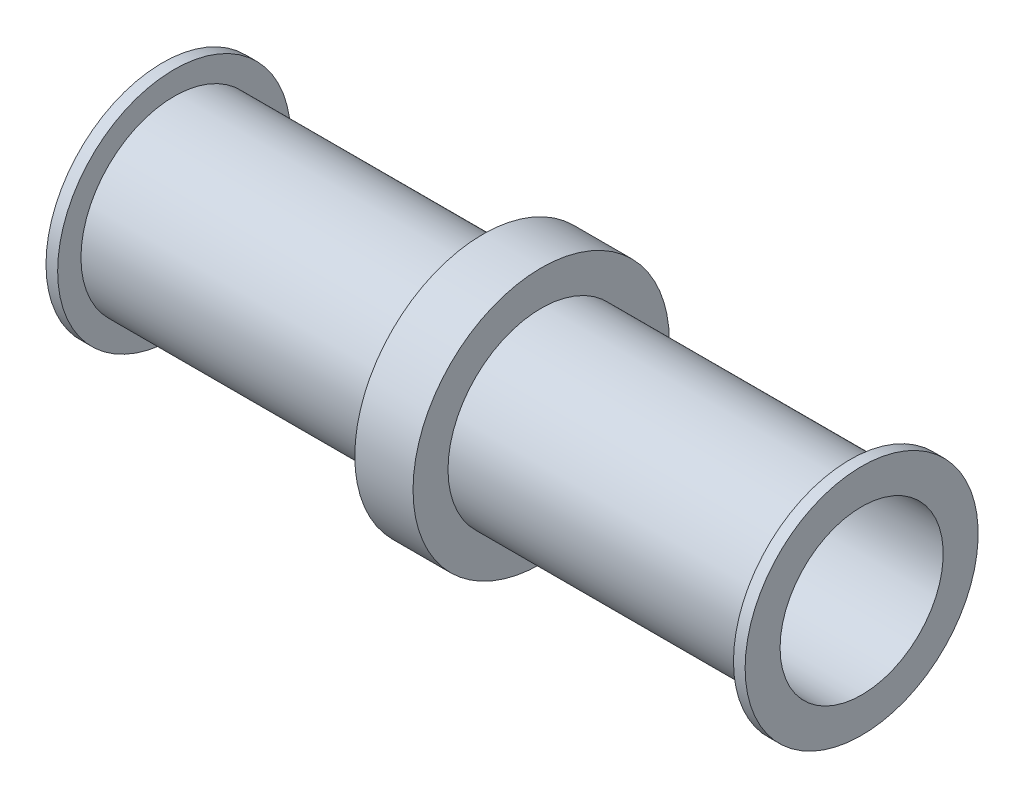
ISO-10303-21;
HEADER;
FILE_DESCRIPTION(('STEP AP214'),'2;1');
FILE_NAME('part.step','',(''),(''),'','','');
FILE_SCHEMA(('AUTOMOTIVE_DESIGN { 1 0 10303 214 1 1 1 1 }'));
ENDSEC;
DATA;
#1=APPLICATION_CONTEXT('core data for automotive mechanical design processes');
#2=APPLICATION_PROTOCOL_DEFINITION('international standard','automotive_design',2000,#1);
#3=PRODUCT_CONTEXT('',#1,'mechanical');
#4=PRODUCT('Part','Part','',(#3));
#5=PRODUCT_RELATED_PRODUCT_CATEGORY('part','',(#4));
#6=PRODUCT_DEFINITION_FORMATION('','',#4);
#7=PRODUCT_DEFINITION_CONTEXT('part definition',#1,'design');
#8=PRODUCT_DEFINITION('design','',#6,#7);
#9=PRODUCT_DEFINITION_SHAPE('','',#8);
#10=(LENGTH_UNIT() NAMED_UNIT(*) SI_UNIT(.MILLI.,.METRE.));
#11=(NAMED_UNIT(*) PLANE_ANGLE_UNIT() SI_UNIT($,.RADIAN.));
#12=(NAMED_UNIT(*) SI_UNIT($,.STERADIAN.) SOLID_ANGLE_UNIT());
#13=UNCERTAINTY_MEASURE_WITH_UNIT(LENGTH_MEASURE(1.E-05),#10,'distance_accuracy_value','');
#14=(GEOMETRIC_REPRESENTATION_CONTEXT(3) GLOBAL_UNCERTAINTY_ASSIGNED_CONTEXT((#13)) GLOBAL_UNIT_ASSIGNED_CONTEXT((#10,
#11,#12)) REPRESENTATION_CONTEXT('',''));
#15=CARTESIAN_POINT('',(0.,0.,0.));
#16=DIRECTION('',(0.,0.,1.));
#17=DIRECTION('',(1.,0.,0.));
#18=AXIS2_PLACEMENT_3D('',#15,#16,#17);
#19=CARTESIAN_POINT('',(0.,0.,0.));
#20=DIRECTION('',(-1.,0.,0.));
#21=DIRECTION('',(0.,0.,1.));
#22=AXIS2_PLACEMENT_3D('',#19,#20,#21);
#23=CYLINDRICAL_SURFACE('',#22,2.54);
#24=CARTESIAN_POINT('',(0.,0.,0.));
#25=DIRECTION('',(-1.,0.,0.));
#26=DIRECTION('',(0.,0.,1.));
#27=AXIS2_PLACEMENT_3D('',#24,#25,#26);
#28=CIRCLE('',#27,2.54);
#29=CARTESIAN_POINT('',(0.,0.,2.54));
#30=VERTEX_POINT('',#29);
#31=EDGE_CURVE('E70',#30,#30,#28,.T.);
#32=ORIENTED_EDGE('',*,*,#31,.F.);
#33=EDGE_LOOP('',(#32));
#34=FACE_BOUND('',#33,.T.);
#35=CARTESIAN_POINT('',(0.254,0.,0.));
#36=DIRECTION('',(-1.,0.,0.));
#37=DIRECTION('',(0.,0.,1.));
#38=AXIS2_PLACEMENT_3D('',#35,#36,#37);
#39=CIRCLE('',#38,2.54);
#40=CARTESIAN_POINT('',(0.254,0.,2.54));
#41=VERTEX_POINT('',#40);
#42=EDGE_CURVE('E10',#41,#41,#39,.T.);
#43=ORIENTED_EDGE('',*,*,#42,.T.);
#44=EDGE_LOOP('',(#43));
#45=FACE_BOUND('',#44,.T.);
#46=ADVANCED_FACE('F30',(#34,#45),#23,.T.);
#47=CARTESIAN_POINT('',(0.254,2.54,0.));
#48=DIRECTION('',(-1.,0.,0.));
#49=DIRECTION('',(0.,0.,1.));
#50=AXIS2_PLACEMENT_3D('',#47,#48,#49);
#51=PLANE('',#50);
#52=ORIENTED_EDGE('',*,*,#42,.F.);
#53=EDGE_LOOP('',(#52));
#54=FACE_BOUND('',#53,.T.);
#55=CARTESIAN_POINT('',(0.254,0.,0.));
#56=DIRECTION('',(-1.,0.,0.));
#57=DIRECTION('',(0.,0.,1.));
#58=AXIS2_PLACEMENT_3D('',#55,#56,#57);
#59=CIRCLE('',#58,2.032);
#60=CARTESIAN_POINT('',(0.254,0.,2.032));
#61=VERTEX_POINT('',#60);
#62=EDGE_CURVE('E36',#61,#61,#59,.T.);
#63=ORIENTED_EDGE('',*,*,#62,.T.);
#64=EDGE_LOOP('',(#63));
#65=FACE_BOUND('',#64,.T.);
#66=ADVANCED_FACE('F77',(#54,#65),#51,.F.);
#67=CARTESIAN_POINT('',(0.,0.,0.));
#68=DIRECTION('',(-1.,0.,0.));
#69=DIRECTION('',(0.,0.,1.));
#70=AXIS2_PLACEMENT_3D('',#67,#68,#69);
#71=CYLINDRICAL_SURFACE('',#70,2.032);
#72=ORIENTED_EDGE('',*,*,#62,.F.);
#73=EDGE_LOOP('',(#72));
#74=FACE_BOUND('',#73,.T.);
#75=CARTESIAN_POINT('',(6.985,0.,0.));
#76=DIRECTION('',(-1.,0.,0.));
#77=DIRECTION('',(0.,0.,1.));
#78=AXIS2_PLACEMENT_3D('',#75,#76,#77);
#79=CIRCLE('',#78,2.032);
#80=CARTESIAN_POINT('',(6.985,0.,2.032));
#81=VERTEX_POINT('',#80);
#82=EDGE_CURVE('E40',#81,#81,#79,.T.);
#83=ORIENTED_EDGE('',*,*,#82,.T.);
#84=EDGE_LOOP('',(#83));
#85=FACE_BOUND('',#84,.T.);
#86=ADVANCED_FACE('F81',(#74,#85),#71,.T.);
#87=CARTESIAN_POINT('',(6.985,2.794,0.));
#88=DIRECTION('',(1.,0.,0.));
#89=DIRECTION('',(0.,0.,-1.));
#90=AXIS2_PLACEMENT_3D('',#87,#88,#89);
#91=PLANE('',#90);
#92=ORIENTED_EDGE('',*,*,#82,.F.);
#93=EDGE_LOOP('',(#92));
#94=FACE_BOUND('',#93,.T.);
#95=CARTESIAN_POINT('',(6.985,0.,0.));
#96=DIRECTION('',(-1.,0.,0.));
#97=DIRECTION('',(0.,0.,1.));
#98=AXIS2_PLACEMENT_3D('',#95,#96,#97);
#99=CIRCLE('',#98,2.794);
#100=CARTESIAN_POINT('',(6.985,0.,2.794));
#101=VERTEX_POINT('',#100);
#102=EDGE_CURVE('E44',#101,#101,#99,.T.);
#103=ORIENTED_EDGE('',*,*,#102,.T.);
#104=EDGE_LOOP('',(#103));
#105=FACE_BOUND('',#104,.T.);
#106=ADVANCED_FACE('F86',(#94,#105),#91,.F.);
#107=CARTESIAN_POINT('',(0.,0.,0.));
#108=DIRECTION('',(-1.,0.,0.));
#109=DIRECTION('',(0.,0.,1.));
#110=AXIS2_PLACEMENT_3D('',#107,#108,#109);
#111=CYLINDRICAL_SURFACE('',#110,2.794);
#112=ORIENTED_EDGE('',*,*,#102,.F.);
#113=EDGE_LOOP('',(#112));
#114=FACE_BOUND('',#113,.T.);
#115=CARTESIAN_POINT('',(8.255,0.,0.));
#116=DIRECTION('',(-1.,0.,0.));
#117=DIRECTION('',(0.,0.,1.));
#118=AXIS2_PLACEMENT_3D('',#115,#116,#117);
#119=CIRCLE('',#118,2.794);
#120=CARTESIAN_POINT('',(8.255,0.,2.794));
#121=VERTEX_POINT('',#120);
#122=EDGE_CURVE('E49',#121,#121,#119,.T.);
#123=ORIENTED_EDGE('',*,*,#122,.T.);
#124=EDGE_LOOP('',(#123));
#125=FACE_BOUND('',#124,.T.);
#126=ADVANCED_FACE('F92',(#114,#125),#111,.T.);
#127=CARTESIAN_POINT('',(8.255,2.032,0.));
#128=DIRECTION('',(-1.,0.,0.));
#129=DIRECTION('',(0.,0.,1.));
#130=AXIS2_PLACEMENT_3D('',#127,#128,#129);
#131=PLANE('',#130);
#132=ORIENTED_EDGE('',*,*,#122,.F.);
#133=EDGE_LOOP('',(#132));
#134=FACE_BOUND('',#133,.T.);
#135=CARTESIAN_POINT('',(8.255,0.,0.));
#136=DIRECTION('',(-1.,0.,0.));
#137=DIRECTION('',(0.,0.,1.));
#138=AXIS2_PLACEMENT_3D('',#135,#136,#137);
#139=CIRCLE('',#138,2.032);
#140=CARTESIAN_POINT('',(8.255,0.,2.032));
#141=VERTEX_POINT('',#140);
#142=EDGE_CURVE('E52',#141,#141,#139,.T.);
#143=ORIENTED_EDGE('',*,*,#142,.T.);
#144=EDGE_LOOP('',(#143));
#145=FACE_BOUND('',#144,.T.);
#146=ADVANCED_FACE('F96',(#134,#145),#131,.F.);
#147=CARTESIAN_POINT('',(0.,0.,0.));
#148=DIRECTION('',(-1.,0.,0.));
#149=DIRECTION('',(0.,0.,1.));
#150=AXIS2_PLACEMENT_3D('',#147,#148,#149);
#151=CYLINDRICAL_SURFACE('',#150,2.032);
#152=ORIENTED_EDGE('',*,*,#142,.F.);
#153=EDGE_LOOP('',(#152));
#154=FACE_BOUND('',#153,.T.);
#155=CARTESIAN_POINT('',(14.986,0.,0.));
#156=DIRECTION('',(-1.,0.,0.));
#157=DIRECTION('',(0.,0.,1.));
#158=AXIS2_PLACEMENT_3D('',#155,#156,#157);
#159=CIRCLE('',#158,2.032);
#160=CARTESIAN_POINT('',(14.986,0.,2.032));
#161=VERTEX_POINT('',#160);
#162=EDGE_CURVE('E55',#161,#161,#159,.T.);
#163=ORIENTED_EDGE('',*,*,#162,.T.);
#164=EDGE_LOOP('',(#163));
#165=FACE_BOUND('',#164,.T.);
#166=ADVANCED_FACE('F100',(#154,#165),#151,.T.);
#167=CARTESIAN_POINT('',(14.986,2.032,0.));
#168=DIRECTION('',(1.,0.,0.));
#169=DIRECTION('',(0.,0.,-1.));
#170=AXIS2_PLACEMENT_3D('',#167,#168,#169);
#171=PLANE('',#170);
#172=ORIENTED_EDGE('',*,*,#162,.F.);
#173=EDGE_LOOP('',(#172));
#174=FACE_BOUND('',#173,.T.);
#175=CARTESIAN_POINT('',(14.986,0.,0.));
#176=DIRECTION('',(-1.,0.,0.));
#177=DIRECTION('',(0.,0.,1.));
#178=AXIS2_PLACEMENT_3D('',#175,#176,#177);
#179=CIRCLE('',#178,2.54);
#180=CARTESIAN_POINT('',(14.986,0.,2.54));
#181=VERTEX_POINT('',#180);
#182=EDGE_CURVE('E58',#181,#181,#179,.T.);
#183=ORIENTED_EDGE('',*,*,#182,.T.);
#184=EDGE_LOOP('',(#183));
#185=FACE_BOUND('',#184,.T.);
#186=ADVANCED_FACE('F104',(#174,#185),#171,.F.);
#187=CARTESIAN_POINT('',(0.,0.,0.));
#188=DIRECTION('',(-1.,0.,0.));
#189=DIRECTION('',(0.,0.,1.));
#190=AXIS2_PLACEMENT_3D('',#187,#188,#189);
#191=CYLINDRICAL_SURFACE('',#190,2.54);
#192=ORIENTED_EDGE('',*,*,#182,.F.);
#193=EDGE_LOOP('',(#192));
#194=FACE_BOUND('',#193,.T.);
#195=CARTESIAN_POINT('',(15.24,0.,0.));
#196=DIRECTION('',(-1.,0.,0.));
#197=DIRECTION('',(0.,0.,1.));
#198=AXIS2_PLACEMENT_3D('',#195,#196,#197);
#199=CIRCLE('',#198,2.54);
#200=CARTESIAN_POINT('',(15.24,0.,2.54));
#201=VERTEX_POINT('',#200);
#202=EDGE_CURVE('E61',#201,#201,#199,.T.);
#203=ORIENTED_EDGE('',*,*,#202,.T.);
#204=EDGE_LOOP('',(#203));
#205=FACE_BOUND('',#204,.T.);
#206=ADVANCED_FACE('F108',(#194,#205),#191,.T.);
#207=CARTESIAN_POINT('',(15.24,2.54,0.));
#208=DIRECTION('',(-1.,0.,0.));
#209=DIRECTION('',(0.,0.,1.));
#210=AXIS2_PLACEMENT_3D('',#207,#208,#209);
#211=PLANE('',#210);
#212=ORIENTED_EDGE('',*,*,#202,.F.);
#213=EDGE_LOOP('',(#212));
#214=FACE_BOUND('',#213,.T.);
#215=CARTESIAN_POINT('',(15.24,0.,0.));
#216=DIRECTION('',(-1.,0.,0.));
#217=DIRECTION('',(0.,0.,1.));
#218=AXIS2_PLACEMENT_3D('',#215,#216,#217);
#219=CIRCLE('',#218,1.778);
#220=CARTESIAN_POINT('',(15.24,0.,1.778));
#221=VERTEX_POINT('',#220);
#222=EDGE_CURVE('E64',#221,#221,#219,.T.);
#223=ORIENTED_EDGE('',*,*,#222,.T.);
#224=EDGE_LOOP('',(#223));
#225=FACE_BOUND('',#224,.T.);
#226=ADVANCED_FACE('F112',(#214,#225),#211,.F.);
#227=CARTESIAN_POINT('',(0.,0.,0.));
#228=DIRECTION('',(-1.,0.,0.));
#229=DIRECTION('',(0.,0.,1.));
#230=AXIS2_PLACEMENT_3D('',#227,#228,#229);
#231=CYLINDRICAL_SURFACE('',#230,1.778);
#232=ORIENTED_EDGE('',*,*,#222,.F.);
#233=EDGE_LOOP('',(#232));
#234=FACE_BOUND('',#233,.T.);
#235=CARTESIAN_POINT('',(0.,0.,0.));
#236=DIRECTION('',(-1.,0.,0.));
#237=DIRECTION('',(0.,0.,1.));
#238=AXIS2_PLACEMENT_3D('',#235,#236,#237);
#239=CIRCLE('',#238,1.778);
#240=CARTESIAN_POINT('',(0.,0.,1.778));
#241=VERTEX_POINT('',#240);
#242=EDGE_CURVE('E67',#241,#241,#239,.T.);
#243=ORIENTED_EDGE('',*,*,#242,.T.);
#244=EDGE_LOOP('',(#243));
#245=FACE_BOUND('',#244,.T.);
#246=ADVANCED_FACE('F116',(#234,#245),#231,.F.);
#247=CARTESIAN_POINT('',(0.,1.778,0.));
#248=DIRECTION('',(1.,0.,0.));
#249=DIRECTION('',(0.,0.,-1.));
#250=AXIS2_PLACEMENT_3D('',#247,#248,#249);
#251=PLANE('',#250);
#252=ORIENTED_EDGE('',*,*,#242,.F.);
#253=EDGE_LOOP('',(#252));
#254=FACE_BOUND('',#253,.T.);
#255=ORIENTED_EDGE('',*,*,#31,.T.);
#256=EDGE_LOOP('',(#255));
#257=FACE_BOUND('',#256,.T.);
#258=ADVANCED_FACE('F74',(#254,#257),#251,.F.);
#259=CLOSED_SHELL('',(#46,#66,#86,#106,#126,#146,#166,#186,#206,#226,#246,#258));
#260=MANIFOLD_SOLID_BREP('B2',#259);
#261=ADVANCED_BREP_SHAPE_REPRESENTATION('',(#18,#260),#14);
#262=SHAPE_DEFINITION_REPRESENTATION(#9,#261);
ENDSEC;
END-ISO-10303-21;
